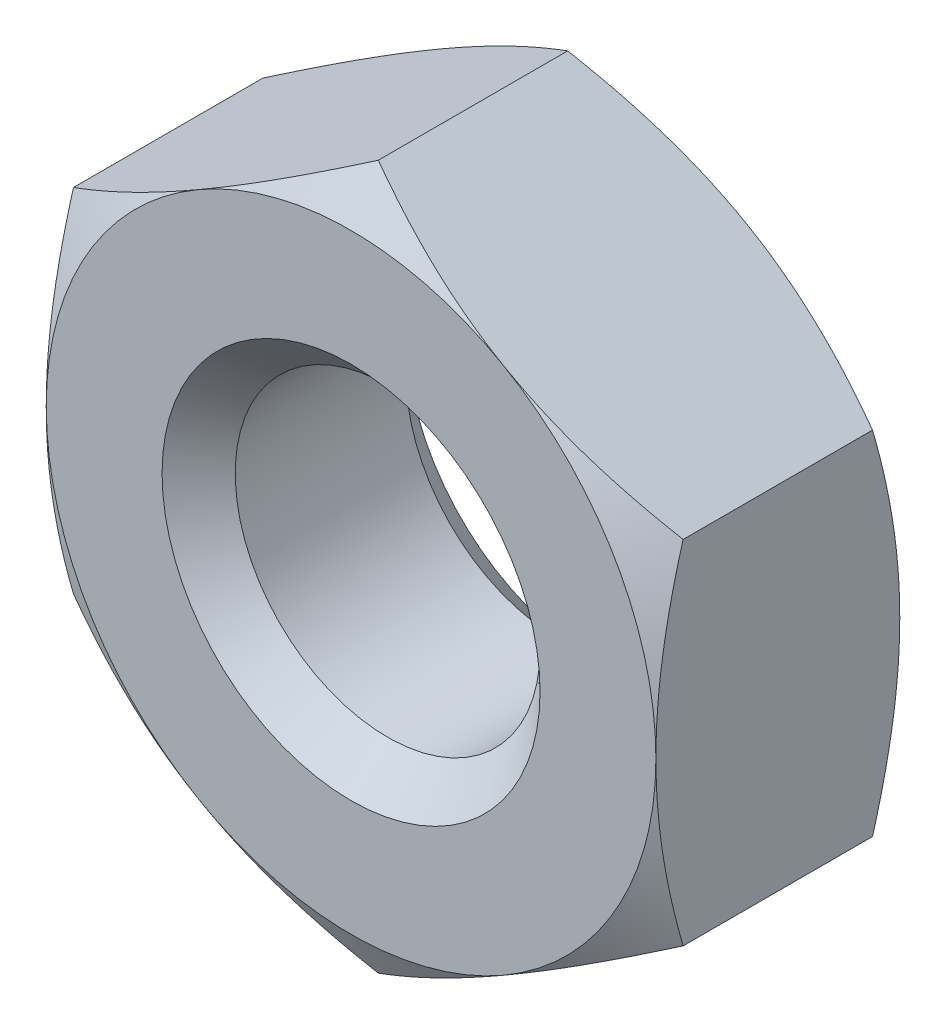
ISO-10303-21;
HEADER;
FILE_DESCRIPTION(('STEP AP214'),'2;1');
FILE_NAME('part.step','',(''),(''),'','','');
FILE_SCHEMA(('AUTOMOTIVE_DESIGN { 1 0 10303 214 1 1 1 1 }'));
ENDSEC;
DATA;
#1=APPLICATION_CONTEXT('core data for automotive mechanical design processes');
#2=APPLICATION_PROTOCOL_DEFINITION('international standard','automotive_design',2000,#1);
#3=PRODUCT_CONTEXT('',#1,'mechanical');
#4=PRODUCT('Part','Part','',(#3));
#5=PRODUCT_RELATED_PRODUCT_CATEGORY('part','',(#4));
#6=PRODUCT_DEFINITION_FORMATION('','',#4);
#7=PRODUCT_DEFINITION_CONTEXT('part definition',#1,'design');
#8=PRODUCT_DEFINITION('design','',#6,#7);
#9=PRODUCT_DEFINITION_SHAPE('','',#8);
#10=(LENGTH_UNIT() NAMED_UNIT(*) SI_UNIT(.MILLI.,.METRE.));
#11=(NAMED_UNIT(*) PLANE_ANGLE_UNIT() SI_UNIT($,.RADIAN.));
#12=(NAMED_UNIT(*) SI_UNIT($,.STERADIAN.) SOLID_ANGLE_UNIT());
#13=UNCERTAINTY_MEASURE_WITH_UNIT(LENGTH_MEASURE(1.E-05),#10,'distance_accuracy_value','');
#14=(GEOMETRIC_REPRESENTATION_CONTEXT(3) GLOBAL_UNCERTAINTY_ASSIGNED_CONTEXT((#13)) GLOBAL_UNIT_ASSIGNED_CONTEXT((#10,
#11,#12)) REPRESENTATION_CONTEXT('',''));
#15=CARTESIAN_POINT('',(0.,0.,0.));
#16=DIRECTION('',(0.,0.,1.));
#17=DIRECTION('',(1.,0.,0.));
#18=AXIS2_PLACEMENT_3D('',#15,#16,#17);
#19=CARTESIAN_POINT('',(0.,0.,2.));
#20=DIRECTION('',(0.,0.,-1.));
#21=DIRECTION('',(-1.,0.,0.));
#22=AXIS2_PLACEMENT_3D('',#19,#20,#21);
#23=CONICAL_SURFACE('',#22,2.49999999999999,1.0471975511966);
#24=CARTESIAN_POINT('',(-0.000200000000001301,2.88686681600197,1.77664233564089));
#25=CARTESIAN_POINT('',(0.10966323473487,2.82343724785375,1.81327837989237));
#26=CARTESIAN_POINT('',(0.220474799896524,2.75946016087834,1.84659778103494));
#27=CARTESIAN_POINT('',(0.444016833466048,2.63039810762178,1.90475771444214));
#28=CARTESIAN_POINT('',(0.556751274528387,2.5653108477275,1.92957767085226));
#29=CARTESIAN_POINT('',(0.780822993875267,2.43594298024479,1.96821434855894));
#30=CARTESIAN_POINT('',(0.892125791767375,2.37168227992023,1.98228820381436));
#31=CARTESIAN_POINT('',(1.11525522746833,2.24285844015415,1.99909084764725));
#32=CARTESIAN_POINT('',(1.22708105401422,2.17829576909553,2.00183354879637));
#33=CARTESIAN_POINT('',(1.43604197555152,2.05765212479586,1.99613423999194));
#34=CARTESIAN_POINT('',(1.53320831755773,2.0015531110824,1.98909160561813));
#35=CARTESIAN_POINT('',(1.726907949711,1.88972057631678,1.96676858087505));
#36=CARTESIAN_POINT('',(1.82344056965973,1.8339874422038,1.95148056155973));
#37=CARTESIAN_POINT('',(2.01753972174048,1.7219242445005,1.91326090615558));
#38=CARTESIAN_POINT('',(2.11508168178214,1.66560836761316,1.89016722387448));
#39=CARTESIAN_POINT('',(2.30871060807608,1.55381665489446,1.83775334342208));
#40=CARTESIAN_POINT('',(2.40480005588618,1.49833938633502,1.80844546437545));
#41=CARTESIAN_POINT('',(2.5002,1.44326020292023,1.77664233564089));
#42=B_SPLINE_CURVE_WITH_KNOTS('',3,(#24,#25,#26,#27,#28,#29,#30,#31,#32,#33,#34,#35,#36,#37,#38,
#39,#40,#41),.UNSPECIFIED.,.F.,.F.,(4,2,2,2,2,2,2,2,4),(0.,0.396285827362226,0.79352433015205,
1.18093086852114,1.56786160134475,1.90479741793733,2.24204551660463,2.58677531536756,
2.93082800105256),.UNSPECIFIED.);
#43=CARTESIAN_POINT('',(0.,2.88675134594813,1.77670900630739));
#44=VERTEX_POINT('',#43);
#45=CARTESIAN_POINT('',(1.25,2.1650635094611,2.));
#46=VERTEX_POINT('',#45);
#47=EDGE_CURVE('E291',#44,#46,#42,.T.);
#48=ORIENTED_EDGE('',*,*,#47,.F.);
#49=CARTESIAN_POINT('',(-2.5002,1.44326020292023,1.77664233564089));
#50=CARTESIAN_POINT('',(-2.39033676526513,1.50668977106845,1.81327837989237));
#51=CARTESIAN_POINT('',(-2.27952520010348,1.57066685804385,1.84659778103494));
#52=CARTESIAN_POINT('',(-2.05598316653395,1.69972891130041,1.90475771444214));
#53=CARTESIAN_POINT('',(-1.94324872547161,1.7648161711947,1.92957767085226));
#54=CARTESIAN_POINT('',(-1.71917700612473,1.8941840386774,1.96821434855894));
#55=CARTESIAN_POINT('',(-1.60787420823262,1.95844473900197,1.98228820381436));
#56=CARTESIAN_POINT('',(-1.38474477253167,2.08726857876804,1.99909084764725));
#57=CARTESIAN_POINT('',(-1.27291894598577,2.15183124982667,2.00183354879637));
#58=CARTESIAN_POINT('',(-1.06395802444848,2.27247489412634,1.99613423999194));
#59=CARTESIAN_POINT('',(-0.96679168244227,2.32857390783979,1.98909160561813));
#60=CARTESIAN_POINT('',(-0.773092050288999,2.44040644260542,1.96676858087505));
#61=CARTESIAN_POINT('',(-0.676559430340269,2.49613957671839,1.95148056155973));
#62=CARTESIAN_POINT('',(-0.482460278259525,2.60820277442169,1.91326090615558));
#63=CARTESIAN_POINT('',(-0.384918318217861,2.66451865130903,1.89016722387448));
#64=CARTESIAN_POINT('',(-0.191289391923916,2.77631036402774,1.83775334342208));
#65=CARTESIAN_POINT('',(-0.0951999441138253,2.83178763258717,1.80844546437545));
#66=CARTESIAN_POINT('',(0.000199999999998379,2.88686681600197,1.77664233564089));
#67=B_SPLINE_CURVE_WITH_KNOTS('',3,(#49,#50,#51,#52,#53,#54,#55,#56,#57,#58,#59,#60,#61,#62,#63,
#64,#65,#66),.UNSPECIFIED.,.F.,.F.,(4,2,2,2,2,2,2,2,4),(0.,0.396285827362227,0.793524330152051,
1.18093086852114,1.56786160134475,1.90479741793733,2.24204551660463,2.58677531536756,
2.93082800105256),.UNSPECIFIED.);
#68=CARTESIAN_POINT('',(-1.25,2.16506350946109,2.));
#69=VERTEX_POINT('',#68);
#70=EDGE_CURVE('E186',#69,#44,#67,.T.);
#71=ORIENTED_EDGE('',*,*,#70,.F.);
#72=CARTESIAN_POINT('',(0.,0.,2.));
#73=DIRECTION('',(0.,0.,1.));
#74=DIRECTION('',(1.,0.,0.));
#75=AXIS2_PLACEMENT_3D('',#72,#73,#74);
#76=CIRCLE('',#75,2.49999999999999);
#77=EDGE_CURVE('E294',#46,#69,#76,.T.);
#78=ORIENTED_EDGE('',*,*,#77,.F.);
#79=EDGE_LOOP('',(#48,#71,#78));
#80=FACE_BOUND('',#79,.T.);
#81=ADVANCED_FACE('F35',(#80),#23,.T.);
#82=CARTESIAN_POINT('',(2.5,1.44337567297406,1.77670900630739));
#83=VERTEX_POINT('',#82);
#84=EDGE_CURVE('E229',#46,#83,#42,.T.);
#85=ORIENTED_EDGE('',*,*,#84,.F.);
#86=CARTESIAN_POINT('',(2.5,0.,2.));
#87=VERTEX_POINT('',#86);
#88=EDGE_CURVE('E151',#87,#46,#76,.T.);
#89=ORIENTED_EDGE('',*,*,#88,.F.);
#90=CARTESIAN_POINT('',(2.5,-3.87737227795232,0.77979313675002));
#91=CARTESIAN_POINT('',(2.5,-3.76818068958348,0.832762008165491));
#92=CARTESIAN_POINT('',(2.5,-3.6587384796046,0.885223086338559));
#93=CARTESIAN_POINT('',(2.5,-3.43921954477317,0.988844078677106));
#94=CARTESIAN_POINT('',(2.5,-3.32914272326816,1.04000378785667));
#95=CARTESIAN_POINT('',(2.5,-3.10765426447243,1.14099379431506));
#96=CARTESIAN_POINT('',(2.5,-2.9962386229426,1.19081533993302));
#97=CARTESIAN_POINT('',(2.5,-2.7725213061051,1.28842003444658));
#98=CARTESIAN_POINT('',(2.5,-2.66021967294288,1.33620327961689));
#99=CARTESIAN_POINT('',(2.5,-2.43092096724548,1.43068939973183));
#100=CARTESIAN_POINT('',(2.5,-2.3138890293604,1.47730812540334));
#101=CARTESIAN_POINT('',(2.5,-2.07845602151588,1.56701798618111));
#102=CARTESIAN_POINT('',(2.5,-1.9600547995981,1.61010872539221));
#103=CARTESIAN_POINT('',(2.5,-1.72191643140316,1.69163159742936));
#104=CARTESIAN_POINT('',(2.5,-1.60218254574553,1.73007315927602));
#105=CARTESIAN_POINT('',(2.5,-1.3609971789188,1.80106427982835));
#106=CARTESIAN_POINT('',(2.5,-1.23954625171813,1.83361569412118));
#107=CARTESIAN_POINT('',(2.5,-0.995534876584823,1.89109058132264));
#108=CARTESIAN_POINT('',(2.5,-0.872984393735114,1.9160555822448));
#109=CARTESIAN_POINT('',(2.5,-0.626358938584124,1.95694779720815));
#110=CARTESIAN_POINT('',(2.5,-0.502284111289258,1.97287586420866));
#111=CARTESIAN_POINT('',(2.5,-0.254850408947678,1.9942151356961));
#112=CARTESIAN_POINT('',(2.5,-0.131503487224332,1.99976153618413));
#113=CARTESIAN_POINT('',(2.5,0.115220442730177,2.00022315611265));
#114=CARTESIAN_POINT('',(2.5,0.238597451467685,1.99513818221843));
#115=CARTESIAN_POINT('',(2.5,0.448047931241357,1.97784054766439));
#116=CARTESIAN_POINT('',(2.5,0.534345626100641,1.96818542536289));
#117=CARTESIAN_POINT('',(2.5,0.706307406130205,1.94427497162806));
#118=CARTESIAN_POINT('',(2.5,0.791971403534972,1.93001901475582));
#119=CARTESIAN_POINT('',(2.5,1.04788877946409,1.88109717983059));
#120=CARTESIAN_POINT('',(2.5,1.21697099599183,1.84028636324471));
#121=CARTESIAN_POINT('',(2.5,1.55535316247419,1.74566880384176));
#122=CARTESIAN_POINT('',(2.5,1.72457550054301,1.69159502678857));
#123=CARTESIAN_POINT('',(2.5,1.97606010818116,1.60395640359262));
#124=CARTESIAN_POINT('',(2.5,2.05948830671247,1.57365901276236));
#125=CARTESIAN_POINT('',(2.5,2.22565579540856,1.51123050964122));
#126=CARTESIAN_POINT('',(2.5,2.3083950931981,1.47909941767674));
#127=CARTESIAN_POINT('',(2.5,2.50178910370827,1.4019292113339));
#128=CARTESIAN_POINT('',(2.5,2.61219601331829,1.35627094627214));
#129=CARTESIAN_POINT('',(2.5,2.83208152280721,1.26276602730984));
#130=CARTESIAN_POINT('',(2.5,2.9415600711202,1.21491925278003));
#131=CARTESIAN_POINT('',(2.5,3.26887677326629,1.06876727238483));
#132=CARTESIAN_POINT('',(2.5,3.48555473812832,0.967867280104535));
#133=CARTESIAN_POINT('',(2.5,3.91694667778471,0.761461343379335));
#134=CARTESIAN_POINT('',(2.5,4.13165848343979,0.655950915073207));
#135=CARTESIAN_POINT('',(2.5,4.55953257139314,0.441822341734688));
#136=CARTESIAN_POINT('',(2.5,4.77269479742369,0.333204084551975));
#137=CARTESIAN_POINT('',(2.5,5.18031783361245,0.122829494039193));
#138=CARTESIAN_POINT('',(2.5,5.37486893535219,0.0212475029400443));
#139=CARTESIAN_POINT('',(2.5,5.76324241323614,-0.183314602035731));
#140=CARTESIAN_POINT('',(2.5,5.95706476422523,-0.286294763619006));
#141=CARTESIAN_POINT('',(2.5,6.34366555964604,-0.493069085324488));
#142=CARTESIAN_POINT('',(2.5,6.53644539741446,-0.596860644228899));
#143=CARTESIAN_POINT('',(2.5,6.92153786001119,-0.805282454493697));
#144=CARTESIAN_POINT('',(2.5,7.11385050959766,-0.909912660089123));
#145=CARTESIAN_POINT('',(2.5,7.30599070013422,-1.01485641723267));
#146=B_SPLINE_CURVE_WITH_KNOTS('',3,(#90,#91,#92,#93,#94,#95,#96,#97,#98,#99,#100,#101,#102,
#103,#104,#105,#106,#107,#108,#109,#110,#111,#112,#113,#114,#115,#116,#117,#118,#119,#120,#121,
#122,#123,#124,#125,#126,#127,#128,#129,#130,#131,#132,#133,#134,#135,#136,#137,#138,#139,#140,
#141,#142,#143,#144,#145),.UNSPECIFIED.,.F.,.F.,(4,2,2,2,2,2,2,2,2,2,2,2,2,2,2,2,2,2,2,2,2,2,2,
2,2,2,2,4),(0.,0.364087595525606,0.728232189786508,1.09435882338059,1.46046814458232,
1.83835013126742,2.21627446425679,2.593418995249,2.97044450586219,3.34536737484773,
3.72025485050397,4.0902254160263,4.46020270963272,4.72058578909651,4.98100428003869,
5.50213080667959,6.03476290085633,6.30102378937355,6.567281726986,6.92567687834834,
7.28409180808606,8.00105528535376,8.7187322767494,9.43643519926078,10.0948519202905,
10.7532911637452,11.4101228359737,12.0669189056634),.UNSPECIFIED.);
#147=EDGE_CURVE('E227',#83,#87,#146,.F.);
#148=ORIENTED_EDGE('',*,*,#147,.F.);
#149=EDGE_LOOP('',(#85,#89,#148));
#150=FACE_BOUND('',#149,.T.);
#151=ADVANCED_FACE('F282',(#150),#23,.T.);
#152=CARTESIAN_POINT('',(2.5,-1.44337567297406,1.77670900630739));
#153=VERTEX_POINT('',#152);
#154=EDGE_CURVE('E222',#87,#153,#146,.F.);
#155=ORIENTED_EDGE('',*,*,#154,.F.);
#156=CARTESIAN_POINT('',(1.25,-2.1650635094611,2.));
#157=VERTEX_POINT('',#156);
#158=EDGE_CURVE('E297',#157,#87,#76,.T.);
#159=ORIENTED_EDGE('',*,*,#158,.F.);
#160=CARTESIAN_POINT('',(2.5002,-1.44326020292023,1.77664233564089));
#161=CARTESIAN_POINT('',(2.39033676526513,-1.50668977106845,1.81327837989237));
#162=CARTESIAN_POINT('',(2.27952520010348,-1.57066685804385,1.84659778103494));
#163=CARTESIAN_POINT('',(2.05598316653395,-1.69972891130041,1.90475771444214));
#164=CARTESIAN_POINT('',(1.94324872547161,-1.7648161711947,1.92957767085226));
#165=CARTESIAN_POINT('',(1.71917700612473,-1.8941840386774,1.96821434855894));
#166=CARTESIAN_POINT('',(1.60787420823262,-1.95844473900197,1.98228820381436));
#167=CARTESIAN_POINT('',(1.38474477253167,-2.08726857876804,1.99909084764725));
#168=CARTESIAN_POINT('',(1.27291894598577,-2.15183124982667,2.00183354879637));
#169=CARTESIAN_POINT('',(1.06395802444848,-2.27247489412634,1.99613423999194));
#170=CARTESIAN_POINT('',(0.966791682442271,-2.32857390783979,1.98909160561813));
#171=CARTESIAN_POINT('',(0.773092050288999,-2.44040644260542,1.96676858087505));
#172=CARTESIAN_POINT('',(0.676559430340269,-2.49613957671839,1.95148056155973));
#173=CARTESIAN_POINT('',(0.482460278259526,-2.60820277442169,1.91326090615558));
#174=CARTESIAN_POINT('',(0.384918318217861,-2.66451865130903,1.89016722387448));
#175=CARTESIAN_POINT('',(0.191289391923917,-2.77631036402774,1.83775334342208));
#176=CARTESIAN_POINT('',(0.0951999441138256,-2.83178763258717,1.80844546437545));
#177=CARTESIAN_POINT('',(-0.000199999999998669,-2.88686681600197,1.77664233564089));
#178=B_SPLINE_CURVE_WITH_KNOTS('',3,(#160,#161,#162,#163,#164,#165,#166,#167,#168,#169,#170,
#171,#172,#173,#174,#175,#176,#177),.UNSPECIFIED.,.F.,.F.,(4,2,2,2,2,2,2,2,4),(0.,
0.396285827362227,0.793524330152051,1.18093086852114,1.56786160134475,1.90479741793733,
2.24204551660463,2.58677531536756,2.93082800105256),.UNSPECIFIED.);
#179=EDGE_CURVE('E228',#153,#157,#178,.T.);
#180=ORIENTED_EDGE('',*,*,#179,.F.);
#181=EDGE_LOOP('',(#155,#159,#180));
#182=FACE_BOUND('',#181,.T.);
#183=ADVANCED_FACE('F287',(#182),#23,.T.);
#184=CARTESIAN_POINT('',(0.,-2.88675134594813,1.7767090063074));
#185=VERTEX_POINT('',#184);
#186=EDGE_CURVE('E216',#157,#185,#178,.T.);
#187=ORIENTED_EDGE('',*,*,#186,.F.);
#188=CARTESIAN_POINT('',(-1.25,-2.1650635094611,2.));
#189=VERTEX_POINT('',#188);
#190=EDGE_CURVE('E299',#189,#157,#76,.T.);
#191=ORIENTED_EDGE('',*,*,#190,.F.);
#192=CARTESIAN_POINT('',(0.000200000000001158,-2.88686681600197,1.77664233564089));
#193=CARTESIAN_POINT('',(-0.10966323473487,-2.82343724785375,1.81327837989237));
#194=CARTESIAN_POINT('',(-0.220474799896524,-2.75946016087834,1.84659778103494));
#195=CARTESIAN_POINT('',(-0.444016833466048,-2.63039810762178,1.90475771444214));
#196=CARTESIAN_POINT('',(-0.556751274528387,-2.5653108477275,1.92957767085226));
#197=CARTESIAN_POINT('',(-0.780822993875267,-2.43594298024479,1.96821434855894));
#198=CARTESIAN_POINT('',(-0.892125791767375,-2.37168227992023,1.98228820381436));
#199=CARTESIAN_POINT('',(-1.11525522746833,-2.24285844015415,1.99909084764725));
#200=CARTESIAN_POINT('',(-1.22708105401422,-2.17829576909553,2.00183354879637));
#201=CARTESIAN_POINT('',(-1.43604197555152,-2.05765212479586,1.99613423999194));
#202=CARTESIAN_POINT('',(-1.53320831755773,-2.0015531110824,1.98909160561813));
#203=CARTESIAN_POINT('',(-1.726907949711,-1.88972057631678,1.96676858087505));
#204=CARTESIAN_POINT('',(-1.82344056965973,-1.8339874422038,1.95148056155973));
#205=CARTESIAN_POINT('',(-2.01753972174048,-1.7219242445005,1.91326090615558));
#206=CARTESIAN_POINT('',(-2.11508168178214,-1.66560836761316,1.89016722387448));
#207=CARTESIAN_POINT('',(-2.30871060807608,-1.55381665489446,1.83775334342208));
#208=CARTESIAN_POINT('',(-2.40480005588618,-1.49833938633502,1.80844546437545));
#209=CARTESIAN_POINT('',(-2.5002,-1.44326020292023,1.77664233564089));
#210=B_SPLINE_CURVE_WITH_KNOTS('',3,(#192,#193,#194,#195,#196,#197,#198,#199,#200,#201,#202,
#203,#204,#205,#206,#207,#208,#209),.UNSPECIFIED.,.F.,.F.,(4,2,2,2,2,2,2,2,4),(0.,
0.396285827362226,0.79352433015205,1.18093086852114,1.56786160134475,1.90479741793733,
2.24204551660463,2.58677531536756,2.93082800105256),.UNSPECIFIED.);
#211=EDGE_CURVE('E323',#185,#189,#210,.T.);
#212=ORIENTED_EDGE('',*,*,#211,.F.);
#213=EDGE_LOOP('',(#187,#191,#212));
#214=FACE_BOUND('',#213,.T.);
#215=ADVANCED_FACE('F327',(#214),#23,.T.);
#216=CARTESIAN_POINT('',(-2.5,-1.44337567297406,1.77670900630739));
#217=VERTEX_POINT('',#216);
#218=EDGE_CURVE('E211',#189,#217,#210,.T.);
#219=ORIENTED_EDGE('',*,*,#218,.F.);
#220=CARTESIAN_POINT('',(-2.5,0.,2.));
#221=VERTEX_POINT('',#220);
#222=EDGE_CURVE('E314',#221,#189,#76,.T.);
#223=ORIENTED_EDGE('',*,*,#222,.F.);
#224=CARTESIAN_POINT('',(-2.5,-3.87737227795232,0.779793136750022));
#225=CARTESIAN_POINT('',(-2.5,-3.76818068958348,0.832762008165492));
#226=CARTESIAN_POINT('',(-2.5,-3.6587384796046,0.88522308633856));
#227=CARTESIAN_POINT('',(-2.5,-3.43921954477317,0.988844078677107));
#228=CARTESIAN_POINT('',(-2.5,-3.32914272326816,1.04000378785667));
#229=CARTESIAN_POINT('',(-2.5,-3.10765426447243,1.14099379431506));
#230=CARTESIAN_POINT('',(-2.5,-2.9962386229426,1.19081533993302));
#231=CARTESIAN_POINT('',(-2.5,-2.7725213061051,1.28842003444658));
#232=CARTESIAN_POINT('',(-2.5,-2.66021967294288,1.33620327961689));
#233=CARTESIAN_POINT('',(-2.5,-2.43092096724548,1.43068939973183));
#234=CARTESIAN_POINT('',(-2.5,-2.31388902936041,1.47730812540334));
#235=CARTESIAN_POINT('',(-2.5,-2.07845602151589,1.56701798618111));
#236=CARTESIAN_POINT('',(-2.5,-1.9600547995981,1.61010872539221));
#237=CARTESIAN_POINT('',(-2.5,-1.72191643140316,1.69163159742936));
#238=CARTESIAN_POINT('',(-2.5,-1.60218254574553,1.73007315927602));
#239=CARTESIAN_POINT('',(-2.5,-1.3609971789188,1.80106427982835));
#240=CARTESIAN_POINT('',(-2.5,-1.23954625171813,1.83361569412118));
#241=CARTESIAN_POINT('',(-2.5,-0.995534876584824,1.89109058132264));
#242=CARTESIAN_POINT('',(-2.5,-0.872984393735115,1.9160555822448));
#243=CARTESIAN_POINT('',(-2.5,-0.626358938584125,1.95694779720815));
#244=CARTESIAN_POINT('',(-2.5,-0.502284111289259,1.97287586420866));
#245=CARTESIAN_POINT('',(-2.5,-0.254850408947679,1.9942151356961));
#246=CARTESIAN_POINT('',(-2.5,-0.131503487224332,1.99976153618413));
#247=CARTESIAN_POINT('',(-2.5,0.115220442730176,2.00022315611265));
#248=CARTESIAN_POINT('',(-2.5,0.238597451467684,1.99513818221843));
#249=CARTESIAN_POINT('',(-2.5,0.448047931241356,1.97784054766439));
#250=CARTESIAN_POINT('',(-2.5,0.534345626100639,1.96818542536289));
#251=CARTESIAN_POINT('',(-2.5,0.706307406130204,1.94427497162806));
#252=CARTESIAN_POINT('',(-2.5,0.79197140353497,1.93001901475582));
#253=CARTESIAN_POINT('',(-2.5,1.04788877946409,1.88109717983059));
#254=CARTESIAN_POINT('',(-2.5,1.21697099599183,1.84028636324471));
#255=CARTESIAN_POINT('',(-2.5,1.55535316247419,1.74566880384176));
#256=CARTESIAN_POINT('',(-2.5,1.72457550054301,1.69159502678857));
#257=CARTESIAN_POINT('',(-2.5,1.97606010818116,1.60395640359262));
#258=CARTESIAN_POINT('',(-2.5,2.05948830671247,1.57365901276236));
#259=CARTESIAN_POINT('',(-2.5,2.22565579540856,1.51123050964122));
#260=CARTESIAN_POINT('',(-2.5,2.3083950931981,1.47909941767674));
#261=CARTESIAN_POINT('',(-2.5,2.50178910370827,1.4019292113339));
#262=CARTESIAN_POINT('',(-2.5,2.61219601331829,1.35627094627214));
#263=CARTESIAN_POINT('',(-2.5,2.83208152280721,1.26276602730984));
#264=CARTESIAN_POINT('',(-2.5,2.9415600711202,1.21491925278003));
#265=CARTESIAN_POINT('',(-2.5,3.26887677326629,1.06876727238483));
#266=CARTESIAN_POINT('',(-2.5,3.48555473812832,0.967867280104535));
#267=CARTESIAN_POINT('',(-2.5,3.91694667778471,0.761461343379335));
#268=CARTESIAN_POINT('',(-2.5,4.13165848343979,0.655950915073207));
#269=CARTESIAN_POINT('',(-2.5,4.55953257139313,0.441822341734687));
#270=CARTESIAN_POINT('',(-2.5,4.77269479742369,0.333204084551975));
#271=CARTESIAN_POINT('',(-2.5,5.18031783361245,0.122829494039193));
#272=CARTESIAN_POINT('',(-2.5,5.37486893535219,0.0212475029400446));
#273=CARTESIAN_POINT('',(-2.5,5.76324241323614,-0.183314602035731));
#274=CARTESIAN_POINT('',(-2.5,5.95706476422522,-0.286294763619005));
#275=CARTESIAN_POINT('',(-2.5,6.34366555964604,-0.493069085324487));
#276=CARTESIAN_POINT('',(-2.5,6.53644539741446,-0.596860644228898));
#277=CARTESIAN_POINT('',(-2.5,6.92153786001119,-0.805282454493696));
#278=CARTESIAN_POINT('',(-2.5,7.11385050959766,-0.909912660089122));
#279=CARTESIAN_POINT('',(-2.5,7.30599070013421,-1.01485641723267));
#280=B_SPLINE_CURVE_WITH_KNOTS('',3,(#224,#225,#226,#227,#228,#229,#230,#231,#232,#233,#234,
#235,#236,#237,#238,#239,#240,#241,#242,#243,#244,#245,#246,#247,#248,#249,#250,#251,#252,#253,
#254,#255,#256,#257,#258,#259,#260,#261,#262,#263,#264,#265,#266,#267,#268,#269,#270,#271,#272,
#273,#274,#275,#276,#277,#278,#279),.UNSPECIFIED.,.F.,.F.,(4,2,2,2,2,2,2,2,2,2,2,2,2,2,2,2,2,2,
2,2,2,2,2,2,2,2,2,4),(0.,0.364087595525606,0.728232189786507,1.09435882338059,1.46046814458232,
1.83835013126741,2.21627446425679,2.593418995249,2.97044450586218,3.34536737484772,
3.72025485050397,4.0902254160263,4.46020270963271,4.72058578909651,4.98100428003869,
5.50213080667959,6.03476290085633,6.30102378937355,6.56728172698599,6.92567687834833,
7.28409180808605,8.00105528535376,8.7187322767494,9.43643519926077,10.0948519202905,
10.7532911637452,11.4101228359737,12.0669189056634),.UNSPECIFIED.);
#281=EDGE_CURVE('E319',#217,#221,#280,.T.);
#282=ORIENTED_EDGE('',*,*,#281,.F.);
#283=EDGE_LOOP('',(#219,#223,#282));
#284=FACE_BOUND('',#283,.T.);
#285=ADVANCED_FACE('F203',(#284),#23,.T.);
#286=CARTESIAN_POINT('',(0.,0.,0.577350269189626));
#287=DIRECTION('',(0.,0.,1.));
#288=DIRECTION('',(1.,0.,0.));
#289=AXIS2_PLACEMENT_3D('',#286,#287,#288);
#290=CONICAL_SURFACE('',#289,3.5,1.0471975511966);
#291=CARTESIAN_POINT('',(-0.000199999999998916,-2.88686681600197,0.223357664359111));
#292=CARTESIAN_POINT('',(0.109663234734872,-2.82343724785375,0.186721620107629));
#293=CARTESIAN_POINT('',(0.220474799896527,-2.75946016087834,0.153402218965059));
#294=CARTESIAN_POINT('',(0.444016833466051,-2.63039810762178,0.0952422855578609));
#295=CARTESIAN_POINT('',(0.556751274528389,-2.5653108477275,0.0704223291477416));
#296=CARTESIAN_POINT('',(0.78082299387527,-2.43594298024479,0.0317856514410556));
#297=CARTESIAN_POINT('',(0.892125791767378,-2.37168227992023,0.0177117961856426));
#298=CARTESIAN_POINT('',(1.11525522746833,-2.24285844015415,0.000909152352754033));
#299=CARTESIAN_POINT('',(1.22708105401423,-2.17829576909553,-0.00183354879636961));
#300=CARTESIAN_POINT('',(1.43604197555152,-2.05765212479586,0.00386576000805727));
#301=CARTESIAN_POINT('',(1.53320831755773,-2.0015531110824,0.0109083943818654));
#302=CARTESIAN_POINT('',(1.726907949711,-1.88972057631678,0.0332314191249463));
#303=CARTESIAN_POINT('',(1.82344056965973,-1.8339874422038,0.0485194384402709));
#304=CARTESIAN_POINT('',(2.01753972174048,-1.7219242445005,0.0867390938444241));
#305=CARTESIAN_POINT('',(2.11508168178214,-1.66560836761316,0.109832776125521));
#306=CARTESIAN_POINT('',(2.30871060807609,-1.55381665489446,0.162246656577917));
#307=CARTESIAN_POINT('',(2.40480005588618,-1.49833938633502,0.191554535624552));
#308=CARTESIAN_POINT('',(2.5002,-1.44326020292023,0.223357664359112));
#309=B_SPLINE_CURVE_WITH_KNOTS('',3,(#291,#292,#293,#294,#295,#296,#297,#298,#299,#300,#301,
#302,#303,#304,#305,#306,#307,#308),.UNSPECIFIED.,.F.,.F.,(4,2,2,2,2,2,2,2,4),(0.,
0.396285827362226,0.793524330152051,1.18093086852114,1.56786160134475,1.90479741793733,
2.24204551660463,2.58677531536756,2.93082800105256),.UNSPECIFIED.);
#310=CARTESIAN_POINT('',(0.,-2.88675134594813,0.223290993692604));
#311=VERTEX_POINT('',#310);
#312=CARTESIAN_POINT('',(1.25,-2.1650635094611,0.));
#313=VERTEX_POINT('',#312);
#314=EDGE_CURVE('E259',#311,#313,#309,.T.);
#315=ORIENTED_EDGE('',*,*,#314,.F.);
#316=CARTESIAN_POINT('',(-2.5002,-1.44326020292023,0.223357664359111));
#317=CARTESIAN_POINT('',(-2.39033676526513,-1.50668977106845,0.186721620107629));
#318=CARTESIAN_POINT('',(-2.27952520010347,-1.57066685804385,0.153402218965059));
#319=CARTESIAN_POINT('',(-2.05598316653395,-1.69972891130041,0.0952422855578611));
#320=CARTESIAN_POINT('',(-1.94324872547161,-1.7648161711947,0.0704223291477416));
#321=CARTESIAN_POINT('',(-1.71917700612473,-1.8941840386774,0.0317856514410554));
#322=CARTESIAN_POINT('',(-1.60787420823262,-1.95844473900197,0.0177117961856422));
#323=CARTESIAN_POINT('',(-1.38474477253167,-2.08726857876804,0.000909152352753463));
#324=CARTESIAN_POINT('',(-1.27291894598577,-2.15183124982667,-0.00183354879637015));
#325=CARTESIAN_POINT('',(-1.06395802444848,-2.27247489412634,0.00386576000805671));
#326=CARTESIAN_POINT('',(-0.966791682442269,-2.32857390783979,0.0109083943818648));
#327=CARTESIAN_POINT('',(-0.773092050288997,-2.44040644260542,0.0332314191249456));
#328=CARTESIAN_POINT('',(-0.676559430340268,-2.49613957671839,0.0485194384402703));
#329=CARTESIAN_POINT('',(-0.482460278259523,-2.60820277442169,0.0867390938444233));
#330=CARTESIAN_POINT('',(-0.384918318217859,-2.66451865130903,0.10983277612552));
#331=CARTESIAN_POINT('',(-0.191289391923914,-2.77631036402774,0.162246656577916));
#332=CARTESIAN_POINT('',(-0.0951999441138231,-2.83178763258717,0.191554535624551));
#333=CARTESIAN_POINT('',(0.000200000000001202,-2.88686681600197,0.223357664359111));
#334=B_SPLINE_CURVE_WITH_KNOTS('',3,(#316,#317,#318,#319,#320,#321,#322,#323,#324,#325,#326,
#327,#328,#329,#330,#331,#332,#333),.UNSPECIFIED.,.F.,.F.,(4,2,2,2,2,2,2,2,4),(0.,
0.396285827362226,0.79352433015205,1.18093086852114,1.56786160134475,1.90479741793733,
2.24204551660463,2.58677531536756,2.93082800105256),.UNSPECIFIED.);
#335=CARTESIAN_POINT('',(-1.25,-2.1650635094611,0.));
#336=VERTEX_POINT('',#335);
#337=EDGE_CURVE('E260',#336,#311,#334,.T.);
#338=ORIENTED_EDGE('',*,*,#337,.F.);
#339=CARTESIAN_POINT('',(0.,0.,0.));
#340=DIRECTION('',(0.,0.,1.));
#341=DIRECTION('',(1.,0.,0.));
#342=AXIS2_PLACEMENT_3D('',#339,#340,#341);
#343=CIRCLE('',#342,2.49999999999999);
#344=EDGE_CURVE('E162',#313,#336,#343,.F.);
#345=ORIENTED_EDGE('',*,*,#344,.F.);
#346=EDGE_LOOP('',(#315,#338,#345));
#347=FACE_BOUND('',#346,.T.);
#348=ADVANCED_FACE('F358',(#347),#290,.T.);
#349=CARTESIAN_POINT('',(2.5,-1.44337567297406,0.223290993692605));
#350=VERTEX_POINT('',#349);
#351=EDGE_CURVE('E254',#313,#350,#309,.T.);
#352=ORIENTED_EDGE('',*,*,#351,.F.);
#353=CARTESIAN_POINT('',(2.5,0.,0.));
#354=VERTEX_POINT('',#353);
#355=EDGE_CURVE('E153',#354,#313,#343,.F.);
#356=ORIENTED_EDGE('',*,*,#355,.F.);
#357=CARTESIAN_POINT('',(2.5,-3.87737227795232,1.22020686324998));
#358=CARTESIAN_POINT('',(2.5,-3.76818068958348,1.16723799183451));
#359=CARTESIAN_POINT('',(2.5,-3.6587384796046,1.11477691366144));
#360=CARTESIAN_POINT('',(2.5,-3.43921954477317,1.01115592132289));
#361=CARTESIAN_POINT('',(2.5,-3.32914272326816,0.959996212143326));
#362=CARTESIAN_POINT('',(2.5,-3.10765426447243,0.859006205684944));
#363=CARTESIAN_POINT('',(2.5,-2.9962386229426,0.809184660066976));
#364=CARTESIAN_POINT('',(2.5,-2.7725213061051,0.711579965553421));
#365=CARTESIAN_POINT('',(2.5,-2.66021967294288,0.663796720383113));
#366=CARTESIAN_POINT('',(2.5,-2.43092096724548,0.569310600268165));
#367=CARTESIAN_POINT('',(2.5,-2.3138890293604,0.522691874596655));
#368=CARTESIAN_POINT('',(2.5,-2.07845602151588,0.43298201381889));
#369=CARTESIAN_POINT('',(2.5,-1.9600547995981,0.389891274607794));
#370=CARTESIAN_POINT('',(2.5,-1.72191643140316,0.308368402570639));
#371=CARTESIAN_POINT('',(2.5,-1.60218254574553,0.269926840723983));
#372=CARTESIAN_POINT('',(2.5,-1.3609971789188,0.198935720171654));
#373=CARTESIAN_POINT('',(2.5,-1.23954625171813,0.166384305878817));
#374=CARTESIAN_POINT('',(2.5,-0.995534876584822,0.108909418677361));
#375=CARTESIAN_POINT('',(2.5,-0.872984393735114,0.0839444177551978));
#376=CARTESIAN_POINT('',(2.5,-0.626358938584124,0.0430522027918473));
#377=CARTESIAN_POINT('',(2.5,-0.502284111289258,0.0271241357913425));
#378=CARTESIAN_POINT('',(2.5,-0.254850408947677,0.00578486430389711));
#379=CARTESIAN_POINT('',(2.5,-0.131503487224332,0.000238463815873854));
#380=CARTESIAN_POINT('',(2.5,0.115220442730177,-0.000223156112651994));
#381=CARTESIAN_POINT('',(2.5,0.238597451467685,0.00486181778157332));
#382=CARTESIAN_POINT('',(2.5,0.448047931241357,0.0221594523356116));
#383=CARTESIAN_POINT('',(2.5,0.534345626100641,0.0318145746371115));
#384=CARTESIAN_POINT('',(2.5,0.706307406130205,0.0557250283719437));
#385=CARTESIAN_POINT('',(2.5,0.791971403534972,0.0699809852441821));
#386=CARTESIAN_POINT('',(2.5,1.04788877946409,0.118902820169406));
#387=CARTESIAN_POINT('',(2.5,1.21697099599183,0.159713636755287));
#388=CARTESIAN_POINT('',(2.5,1.55535316247419,0.254331196158239));
#389=CARTESIAN_POINT('',(2.5,1.72457550054301,0.308404973211432));
#390=CARTESIAN_POINT('',(2.5,1.97606010818117,0.396043596407382));
#391=CARTESIAN_POINT('',(2.5,2.05948830671247,0.426340987237636));
#392=CARTESIAN_POINT('',(2.5,2.22565579540856,0.48876949035878));
#393=CARTESIAN_POINT('',(2.5,2.3083950931981,0.520900582323258));
#394=CARTESIAN_POINT('',(2.5,2.50178910370828,0.598070788666104));
#395=CARTESIAN_POINT('',(2.5,2.6121960133183,0.643729053727855));
#396=CARTESIAN_POINT('',(2.5,2.83208152280721,0.73723397269016));
#397=CARTESIAN_POINT('',(2.5,2.94156007112021,0.785080747219969));
#398=CARTESIAN_POINT('',(2.5,3.26887677326629,0.931232727615166));
#399=CARTESIAN_POINT('',(2.5,3.48555473812832,1.03213271989546));
#400=CARTESIAN_POINT('',(2.5,3.91694667778471,1.23853865662066));
#401=CARTESIAN_POINT('',(2.5,4.13165848343979,1.34404908492679));
#402=CARTESIAN_POINT('',(2.5,4.55953257139314,1.55817765826531));
#403=CARTESIAN_POINT('',(2.5,4.77269479742369,1.66679591544803));
#404=CARTESIAN_POINT('',(2.5,5.18031783361245,1.87717050596081));
#405=CARTESIAN_POINT('',(2.5,5.3748689353522,1.97875249705995));
#406=CARTESIAN_POINT('',(2.5,5.76324241323614,2.18331460203573));
#407=CARTESIAN_POINT('',(2.5,5.95706476422523,2.286294763619));
#408=CARTESIAN_POINT('',(2.5,6.34366555964605,2.49306908532449));
#409=CARTESIAN_POINT('',(2.5,6.53644539741446,2.5968606442289));
#410=CARTESIAN_POINT('',(2.5,6.92153786001119,2.80528245449369));
#411=CARTESIAN_POINT('',(2.5,7.11385050959766,2.90991266008912));
#412=CARTESIAN_POINT('',(2.5,7.30599070013422,3.01485641723267));
#413=B_SPLINE_CURVE_WITH_KNOTS('',3,(#357,#358,#359,#360,#361,#362,#363,#364,#365,#366,#367,
#368,#369,#370,#371,#372,#373,#374,#375,#376,#377,#378,#379,#380,#381,#382,#383,#384,#385,#386,
#387,#388,#389,#390,#391,#392,#393,#394,#395,#396,#397,#398,#399,#400,#401,#402,#403,#404,#405,
#406,#407,#408,#409,#410,#411,#412),.UNSPECIFIED.,.F.,.F.,(4,2,2,2,2,2,2,2,2,2,2,2,2,2,2,2,2,2,
2,2,2,2,2,2,2,2,2,4),(0.,0.364087595525606,0.728232189786508,1.09435882338059,1.46046814458232,
1.83835013126741,2.21627446425679,2.593418995249,2.97044450586219,3.34536737484773,
3.72025485050397,4.0902254160263,4.46020270963272,4.72058578909651,4.98100428003869,
5.50213080667959,6.03476290085633,6.30102378937355,6.567281726986,6.92567687834834,
7.28409180808606,8.00105528535376,8.7187322767494,9.43643519926078,10.0948519202905,
10.7532911637452,11.4101228359737,12.0669189056634),.UNSPECIFIED.);
#414=EDGE_CURVE('E249',#350,#354,#413,.T.);
#415=ORIENTED_EDGE('',*,*,#414,.F.);
#416=EDGE_LOOP('',(#352,#356,#415));
#417=FACE_BOUND('',#416,.T.);
#418=ADVANCED_FACE('F353',(#417),#290,.T.);
#419=CARTESIAN_POINT('',(2.5,1.44337567297406,0.223290993692604));
#420=VERTEX_POINT('',#419);
#421=EDGE_CURVE('E147',#354,#420,#413,.T.);
#422=ORIENTED_EDGE('',*,*,#421,.F.);
#423=CARTESIAN_POINT('',(1.25,2.1650635094611,0.));
#424=VERTEX_POINT('',#423);
#425=EDGE_CURVE('E145',#424,#354,#343,.F.);
#426=ORIENTED_EDGE('',*,*,#425,.F.);
#427=CARTESIAN_POINT('',(2.5002,1.44326020292023,0.223357664359111));
#428=CARTESIAN_POINT('',(2.39033676526513,1.50668977106845,0.186721620107629));
#429=CARTESIAN_POINT('',(2.27952520010347,1.57066685804385,0.153402218965059));
#430=CARTESIAN_POINT('',(2.05598316653395,1.69972891130041,0.0952422855578611));
#431=CARTESIAN_POINT('',(1.94324872547161,1.7648161711947,0.0704223291477416));
#432=CARTESIAN_POINT('',(1.71917700612473,1.8941840386774,0.0317856514410554));
#433=CARTESIAN_POINT('',(1.60787420823262,1.95844473900197,0.0177117961856422));
#434=CARTESIAN_POINT('',(1.38474477253167,2.08726857876804,0.000909152352753463));
#435=CARTESIAN_POINT('',(1.27291894598577,2.15183124982667,-0.00183354879637015));
#436=CARTESIAN_POINT('',(1.06395802444848,2.27247489412634,0.00386576000805671));
#437=CARTESIAN_POINT('',(0.966791682442269,2.32857390783979,0.0109083943818648));
#438=CARTESIAN_POINT('',(0.773092050288997,2.44040644260542,0.0332314191249456));
#439=CARTESIAN_POINT('',(0.676559430340268,2.49613957671839,0.0485194384402703));
#440=CARTESIAN_POINT('',(0.482460278259523,2.60820277442169,0.0867390938444233));
#441=CARTESIAN_POINT('',(0.384918318217859,2.66451865130903,0.10983277612552));
#442=CARTESIAN_POINT('',(0.191289391923914,2.77631036402774,0.162246656577916));
#443=CARTESIAN_POINT('',(0.0951999441138231,2.83178763258717,0.191554535624551));
#444=CARTESIAN_POINT('',(-0.000200000000001202,2.88686681600197,0.223357664359111));
#445=B_SPLINE_CURVE_WITH_KNOTS('',3,(#427,#428,#429,#430,#431,#432,#433,#434,#435,#436,#437,
#438,#439,#440,#441,#442,#443,#444),.UNSPECIFIED.,.F.,.F.,(4,2,2,2,2,2,2,2,4),(0.,
0.396285827362226,0.79352433015205,1.18093086852114,1.56786160134475,1.90479741793733,
2.24204551660463,2.58677531536756,2.93082800105256),.UNSPECIFIED.);
#446=EDGE_CURVE('E125',#420,#424,#445,.T.);
#447=ORIENTED_EDGE('',*,*,#446,.F.);
#448=EDGE_LOOP('',(#422,#426,#447));
#449=FACE_BOUND('',#448,.T.);
#450=ADVANCED_FACE('F146',(#449),#290,.T.);
#451=CARTESIAN_POINT('',(-2.5,-1.44337567297406,0.223290993692604));
#452=VERTEX_POINT('',#451);
#453=EDGE_CURVE('E250',#452,#336,#334,.T.);
#454=ORIENTED_EDGE('',*,*,#453,.F.);
#455=CARTESIAN_POINT('',(-2.5,-3.87737227795232,1.22020686324998));
#456=CARTESIAN_POINT('',(-2.5,-3.76818068958348,1.16723799183451));
#457=CARTESIAN_POINT('',(-2.5,-3.6587384796046,1.11477691366144));
#458=CARTESIAN_POINT('',(-2.5,-3.43921954477317,1.01115592132289));
#459=CARTESIAN_POINT('',(-2.5,-3.32914272326816,0.959996212143324));
#460=CARTESIAN_POINT('',(-2.5,-3.10765426447243,0.859006205684942));
#461=CARTESIAN_POINT('',(-2.5,-2.9962386229426,0.809184660066975));
#462=CARTESIAN_POINT('',(-2.5,-2.7725213061051,0.711579965553419));
#463=CARTESIAN_POINT('',(-2.5,-2.66021967294288,0.663796720383112));
#464=CARTESIAN_POINT('',(-2.5,-2.43092096724548,0.569310600268164));
#465=CARTESIAN_POINT('',(-2.5,-2.3138890293604,0.522691874596654));
#466=CARTESIAN_POINT('',(-2.5,-2.07845602151588,0.432982013818889));
#467=CARTESIAN_POINT('',(-2.5,-1.9600547995981,0.389891274607792));
#468=CARTESIAN_POINT('',(-2.5,-1.72191643140316,0.308368402570638));
#469=CARTESIAN_POINT('',(-2.5,-1.60218254574553,0.269926840723982));
#470=CARTESIAN_POINT('',(-2.5,-1.3609971789188,0.198935720171653));
#471=CARTESIAN_POINT('',(-2.5,-1.23954625171813,0.166384305878816));
#472=CARTESIAN_POINT('',(-2.5,-0.995534876584823,0.10890941867736));
#473=CARTESIAN_POINT('',(-2.5,-0.872984393735115,0.0839444177551974));
#474=CARTESIAN_POINT('',(-2.5,-0.626358938584125,0.0430522027918471));
#475=CARTESIAN_POINT('',(-2.5,-0.502284111289259,0.0271241357913424));
#476=CARTESIAN_POINT('',(-2.5,-0.254850408947679,0.00578486430389675));
#477=CARTESIAN_POINT('',(-2.5,-0.131503487224333,0.000238463815873187));
#478=CARTESIAN_POINT('',(-2.5,0.115220442730176,-0.000223156112652668));
#479=CARTESIAN_POINT('',(-2.5,0.238597451467684,0.00486181778157289));
#480=CARTESIAN_POINT('',(-2.5,0.448047931241356,0.0221594523356114));
#481=CARTESIAN_POINT('',(-2.5,0.53434562610064,0.0318145746371114));
#482=CARTESIAN_POINT('',(-2.5,0.706307406130204,0.0557250283719438));
#483=CARTESIAN_POINT('',(-2.5,0.791971403534971,0.0699809852441822));
#484=CARTESIAN_POINT('',(-2.5,1.04788877946409,0.118902820169406));
#485=CARTESIAN_POINT('',(-2.5,1.21697099599183,0.159713636755287));
#486=CARTESIAN_POINT('',(-2.5,1.55535316247419,0.25433119615824));
#487=CARTESIAN_POINT('',(-2.5,1.72457550054301,0.308404973211432));
#488=CARTESIAN_POINT('',(-2.5,1.97606010818117,0.396043596407382));
#489=CARTESIAN_POINT('',(-2.5,2.05948830671247,0.426340987237637));
#490=CARTESIAN_POINT('',(-2.5,2.22565579540856,0.48876949035878));
#491=CARTESIAN_POINT('',(-2.5,2.3083950931981,0.520900582323258));
#492=CARTESIAN_POINT('',(-2.5,2.50178910370827,0.598070788666104));
#493=CARTESIAN_POINT('',(-2.5,2.61219601331829,0.643729053727855));
#494=CARTESIAN_POINT('',(-2.5,2.83208152280721,0.73723397269016));
#495=CARTESIAN_POINT('',(-2.5,2.9415600711202,0.785080747219969));
#496=CARTESIAN_POINT('',(-2.5,3.26887677326629,0.931232727615165));
#497=CARTESIAN_POINT('',(-2.5,3.48555473812832,1.03213271989546));
#498=CARTESIAN_POINT('',(-2.5,3.91694667778471,1.23853865662066));
#499=CARTESIAN_POINT('',(-2.5,4.13165848343979,1.34404908492679));
#500=CARTESIAN_POINT('',(-2.5,4.55953257139313,1.55817765826531));
#501=CARTESIAN_POINT('',(-2.5,4.77269479742369,1.66679591544802));
#502=CARTESIAN_POINT('',(-2.5,5.18031783361245,1.87717050596081));
#503=CARTESIAN_POINT('',(-2.5,5.37486893535219,1.97875249705995));
#504=CARTESIAN_POINT('',(-2.5,5.76324241323614,2.18331460203573));
#505=CARTESIAN_POINT('',(-2.5,5.95706476422522,2.286294763619));
#506=CARTESIAN_POINT('',(-2.5,6.34366555964604,2.49306908532448));
#507=CARTESIAN_POINT('',(-2.5,6.53644539741446,2.5968606442289));
#508=CARTESIAN_POINT('',(-2.5,6.92153786001118,2.80528245449369));
#509=CARTESIAN_POINT('',(-2.5,7.11385050959766,2.90991266008912));
#510=CARTESIAN_POINT('',(-2.5,7.30599070013422,3.01485641723267));
#511=B_SPLINE_CURVE_WITH_KNOTS('',3,(#455,#456,#457,#458,#459,#460,#461,#462,#463,#464,#465,
#466,#467,#468,#469,#470,#471,#472,#473,#474,#475,#476,#477,#478,#479,#480,#481,#482,#483,#484,
#485,#486,#487,#488,#489,#490,#491,#492,#493,#494,#495,#496,#497,#498,#499,#500,#501,#502,#503,
#504,#505,#506,#507,#508,#509,#510),.UNSPECIFIED.,.F.,.F.,(4,2,2,2,2,2,2,2,2,2,2,2,2,2,2,2,2,2,
2,2,2,2,2,2,2,2,2,4),(0.,0.364087595525606,0.728232189786508,1.09435882338059,1.46046814458232,
1.83835013126742,2.21627446425679,2.593418995249,2.97044450586219,3.34536737484773,
3.72025485050397,4.0902254160263,4.46020270963271,4.72058578909651,4.98100428003869,
5.50213080667959,6.03476290085633,6.30102378937355,6.567281726986,6.92567687834834,
7.28409180808605,8.00105528535376,8.71873227674939,9.43643519926077,10.0948519202905,
10.7532911637452,11.4101228359737,12.0669189056634),.UNSPECIFIED.);
#512=CARTESIAN_POINT('',(-2.5,0.,0.));
#513=VERTEX_POINT('',#512);
#514=EDGE_CURVE('E135',#513,#452,#511,.F.);
#515=ORIENTED_EDGE('',*,*,#514,.F.);
#516=EDGE_CURVE('E158',#336,#513,#343,.F.);
#517=ORIENTED_EDGE('',*,*,#516,.F.);
#518=EDGE_LOOP('',(#454,#515,#517));
#519=FACE_BOUND('',#518,.T.);
#520=ADVANCED_FACE('F360',(#519),#290,.T.);
#521=CARTESIAN_POINT('',(0.,2.88675134594813,0.223290993692604));
#522=VERTEX_POINT('',#521);
#523=EDGE_CURVE('E129',#424,#522,#445,.T.);
#524=ORIENTED_EDGE('',*,*,#523,.F.);
#525=CARTESIAN_POINT('',(-1.25,2.16506350946109,0.));
#526=VERTEX_POINT('',#525);
#527=EDGE_CURVE('E141',#526,#424,#343,.F.);
#528=ORIENTED_EDGE('',*,*,#527,.F.);
#529=CARTESIAN_POINT('',(0.000199999999998699,2.88686681600197,0.223357664359111));
#530=CARTESIAN_POINT('',(-0.109663234734872,2.82343724785375,0.186721620107629));
#531=CARTESIAN_POINT('',(-0.220474799896527,2.75946016087834,0.153402218965059));
#532=CARTESIAN_POINT('',(-0.444016833466051,2.63039810762178,0.0952422855578609));
#533=CARTESIAN_POINT('',(-0.556751274528389,2.5653108477275,0.0704223291477416));
#534=CARTESIAN_POINT('',(-0.78082299387527,2.43594298024479,0.0317856514410554));
#535=CARTESIAN_POINT('',(-0.892125791767378,2.37168227992023,0.0177117961856423));
#536=CARTESIAN_POINT('',(-1.11525522746833,2.24285844015415,0.000909152352753698));
#537=CARTESIAN_POINT('',(-1.22708105401423,2.17829576909552,-0.00183354879636982));
#538=CARTESIAN_POINT('',(-1.43604197555152,2.05765212479586,0.0038657600080571));
#539=CARTESIAN_POINT('',(-1.53320831755773,2.0015531110824,0.0109083943818652));
#540=CARTESIAN_POINT('',(-1.726907949711,1.88972057631678,0.0332314191249459));
#541=CARTESIAN_POINT('',(-1.82344056965973,1.8339874422038,0.0485194384402704));
#542=CARTESIAN_POINT('',(-2.01753972174048,1.7219242445005,0.0867390938444236));
#543=CARTESIAN_POINT('',(-2.11508168178214,1.66560836761316,0.10983277612552));
#544=CARTESIAN_POINT('',(-2.30871060807609,1.55381665489446,0.162246656577916));
#545=CARTESIAN_POINT('',(-2.40480005588618,1.49833938633502,0.191554535624551));
#546=CARTESIAN_POINT('',(-2.5002,1.44326020292023,0.223357664359111));
#547=B_SPLINE_CURVE_WITH_KNOTS('',3,(#529,#530,#531,#532,#533,#534,#535,#536,#537,#538,#539,
#540,#541,#542,#543,#544,#545,#546),.UNSPECIFIED.,.F.,.F.,(4,2,2,2,2,2,2,2,4),(0.,
0.396285827362226,0.79352433015205,1.18093086852114,1.56786160134475,1.90479741793733,
2.24204551660463,2.58677531536756,2.93082800105256),.UNSPECIFIED.);
#548=EDGE_CURVE('E57',#522,#526,#547,.T.);
#549=ORIENTED_EDGE('',*,*,#548,.F.);
#550=EDGE_LOOP('',(#524,#528,#549));
#551=FACE_BOUND('',#550,.T.);
#552=ADVANCED_FACE('F139',(#551),#290,.T.);
#553=CARTESIAN_POINT('',(0.,0.,2.));
#554=DIRECTION('',(0.,0.,-1.));
#555=DIRECTION('',(-1.,0.,0.));
#556=AXIS2_PLACEMENT_3D('',#553,#554,#555);
#557=CYLINDRICAL_SURFACE('',#556,1.25);
#558=CARTESIAN_POINT('',(0.,0.,0.300000000000001));
#559=DIRECTION('',(0.,0.,1.));
#560=DIRECTION('',(1.,0.,0.));
#561=AXIS2_PLACEMENT_3D('',#558,#559,#560);
#562=CIRCLE('',#561,1.25);
#563=CARTESIAN_POINT('',(1.25,0.,0.300000000000001));
#564=VERTEX_POINT('',#563);
#565=EDGE_CURVE('E43',#564,#564,#562,.F.);
#566=ORIENTED_EDGE('',*,*,#565,.T.);
#567=EDGE_LOOP('',(#566));
#568=FACE_BOUND('',#567,.T.);
#569=CARTESIAN_POINT('',(0.,0.,1.7));
#570=DIRECTION('',(0.,0.,1.));
#571=DIRECTION('',(1.,0.,0.));
#572=AXIS2_PLACEMENT_3D('',#569,#570,#571);
#573=CIRCLE('',#572,1.25);
#574=CARTESIAN_POINT('',(1.25,0.,1.7));
#575=VERTEX_POINT('',#574);
#576=EDGE_CURVE('E264',#575,#575,#573,.T.);
#577=ORIENTED_EDGE('',*,*,#576,.T.);
#578=EDGE_LOOP('',(#577));
#579=FACE_BOUND('',#578,.T.);
#580=ADVANCED_FACE('F204',(#568,#579),#557,.F.);
#581=CARTESIAN_POINT('',(0.,0.,2.));
#582=DIRECTION('',(0.,0.,1.));
#583=DIRECTION('',(1.,0.,0.));
#584=AXIS2_PLACEMENT_3D('',#581,#582,#583);
#585=PLANE('',#584);
#586=CARTESIAN_POINT('',(0.,0.,2.));
#587=DIRECTION('',(0.,0.,1.));
#588=DIRECTION('',(1.,0.,0.));
#589=AXIS2_PLACEMENT_3D('',#586,#587,#588);
#590=CIRCLE('',#589,1.55);
#591=CARTESIAN_POINT('',(1.55,0.,2.));
#592=VERTEX_POINT('',#591);
#593=EDGE_CURVE('E11',#592,#592,#590,.F.);
#594=ORIENTED_EDGE('',*,*,#593,.T.);
#595=EDGE_LOOP('',(#594));
#596=FACE_BOUND('',#595,.T.);
#597=ORIENTED_EDGE('',*,*,#88,.T.);
#598=ORIENTED_EDGE('',*,*,#77,.T.);
#599=EDGE_CURVE('E312',#69,#221,#76,.T.);
#600=ORIENTED_EDGE('',*,*,#599,.T.);
#601=ORIENTED_EDGE('',*,*,#222,.T.);
#602=ORIENTED_EDGE('',*,*,#190,.T.);
#603=ORIENTED_EDGE('',*,*,#158,.T.);
#604=EDGE_LOOP('',(#597,#598,#600,#601,#602,#603));
#605=FACE_BOUND('',#604,.T.);
#606=ADVANCED_FACE('F276',(#596,#605),#585,.T.);
#607=CARTESIAN_POINT('',(0.,0.,0.));
#608=DIRECTION('',(0.,0.,1.));
#609=DIRECTION('',(1.,0.,0.));
#610=AXIS2_PLACEMENT_3D('',#607,#608,#609);
#611=PLANE('',#610);
#612=CARTESIAN_POINT('',(0.,0.,0.));
#613=DIRECTION('',(0.,0.,1.));
#614=DIRECTION('',(1.,0.,0.));
#615=AXIS2_PLACEMENT_3D('',#612,#613,#614);
#616=CIRCLE('',#615,1.55);
#617=CARTESIAN_POINT('',(1.55,0.,0.));
#618=VERTEX_POINT('',#617);
#619=EDGE_CURVE('E261',#618,#618,#616,.T.);
#620=ORIENTED_EDGE('',*,*,#619,.T.);
#621=EDGE_LOOP('',(#620));
#622=FACE_BOUND('',#621,.T.);
#623=ORIENTED_EDGE('',*,*,#355,.T.);
#624=ORIENTED_EDGE('',*,*,#344,.T.);
#625=ORIENTED_EDGE('',*,*,#516,.T.);
#626=EDGE_CURVE('E157',#513,#526,#343,.F.);
#627=ORIENTED_EDGE('',*,*,#626,.T.);
#628=ORIENTED_EDGE('',*,*,#527,.T.);
#629=ORIENTED_EDGE('',*,*,#425,.T.);
#630=EDGE_LOOP('',(#623,#624,#625,#627,#628,#629));
#631=FACE_BOUND('',#630,.T.);
#632=ADVANCED_FACE('F154',(#622,#631),#611,.F.);
#633=CARTESIAN_POINT('',(-2.5,1.44337567297406,1.77670900630739));
#634=VERTEX_POINT('',#633);
#635=EDGE_CURVE('E193',#221,#634,#280,.T.);
#636=ORIENTED_EDGE('',*,*,#635,.F.);
#637=ORIENTED_EDGE('',*,*,#599,.F.);
#638=EDGE_CURVE('E50',#634,#69,#67,.T.);
#639=ORIENTED_EDGE('',*,*,#638,.F.);
#640=EDGE_LOOP('',(#636,#637,#639));
#641=FACE_BOUND('',#640,.T.);
#642=ADVANCED_FACE('F198',(#641),#23,.T.);
#643=CARTESIAN_POINT('',(-2.5,1.44337567297406,0.223290993692604));
#644=VERTEX_POINT('',#643);
#645=EDGE_CURVE('E143',#644,#513,#511,.F.);
#646=ORIENTED_EDGE('',*,*,#645,.F.);
#647=EDGE_CURVE('E161',#526,#644,#547,.T.);
#648=ORIENTED_EDGE('',*,*,#647,.F.);
#649=ORIENTED_EDGE('',*,*,#626,.F.);
#650=EDGE_LOOP('',(#646,#648,#649));
#651=FACE_BOUND('',#650,.T.);
#652=ADVANCED_FACE('F174',(#651),#290,.T.);
#653=CARTESIAN_POINT('',(1.25,2.1650635094611,2.));
#654=DIRECTION('',(-0.5,-0.866025403784439,0.));
#655=DIRECTION('',(0.866025403784439,-0.5,0.));
#656=AXIS2_PLACEMENT_3D('',#653,#654,#655);
#657=PLANE('',#656);
#658=ORIENTED_EDGE('',*,*,#47,.T.);
#659=ORIENTED_EDGE('',*,*,#84,.T.);
#660=DIRECTION('',(0.,0.,-1.));
#661=VECTOR('',#660,1.);
#662=CARTESIAN_POINT('',(2.5,1.44337567297406,2.));
#663=LINE('',#662,#661);
#664=EDGE_CURVE('E131',#83,#420,#663,.T.);
#665=ORIENTED_EDGE('',*,*,#664,.T.);
#666=ORIENTED_EDGE('',*,*,#446,.T.);
#667=ORIENTED_EDGE('',*,*,#523,.T.);
#668=DIRECTION('',(0.,0.,-1.));
#669=VECTOR('',#668,1.);
#670=CARTESIAN_POINT('',(0.,2.88675134594813,2.));
#671=LINE('',#670,#669);
#672=EDGE_CURVE('E343',#44,#522,#671,.T.);
#673=ORIENTED_EDGE('',*,*,#672,.F.);
#674=EDGE_LOOP('',(#658,#659,#665,#666,#667,#673));
#675=FACE_BOUND('',#674,.T.);
#676=ADVANCED_FACE('F127',(#675),#657,.F.);
#677=CARTESIAN_POINT('',(2.5,0.,2.));
#678=DIRECTION('',(-1.,0.,0.));
#679=DIRECTION('',(0.,-1.,0.));
#680=AXIS2_PLACEMENT_3D('',#677,#678,#679);
#681=PLANE('',#680);
#682=ORIENTED_EDGE('',*,*,#147,.T.);
#683=ORIENTED_EDGE('',*,*,#154,.T.);
#684=DIRECTION('',(0.,0.,-1.));
#685=VECTOR('',#684,1.);
#686=CARTESIAN_POINT('',(2.5,-1.44337567297406,2.));
#687=LINE('',#686,#685);
#688=EDGE_CURVE('E335',#153,#350,#687,.T.);
#689=ORIENTED_EDGE('',*,*,#688,.T.);
#690=ORIENTED_EDGE('',*,*,#414,.T.);
#691=ORIENTED_EDGE('',*,*,#421,.T.);
#692=ORIENTED_EDGE('',*,*,#664,.F.);
#693=EDGE_LOOP('',(#682,#683,#689,#690,#691,#692));
#694=FACE_BOUND('',#693,.T.);
#695=ADVANCED_FACE('F234',(#694),#681,.F.);
#696=CARTESIAN_POINT('',(1.25,-2.1650635094611,2.));
#697=DIRECTION('',(-0.5,0.866025403784439,0.));
#698=DIRECTION('',(-0.866025403784439,-0.5,0.));
#699=AXIS2_PLACEMENT_3D('',#696,#697,#698);
#700=PLANE('',#699);
#701=ORIENTED_EDGE('',*,*,#179,.T.);
#702=ORIENTED_EDGE('',*,*,#186,.T.);
#703=DIRECTION('',(0.,0.,-1.));
#704=VECTOR('',#703,1.);
#705=CARTESIAN_POINT('',(0.,-2.88675134594813,2.));
#706=LINE('',#705,#704);
#707=EDGE_CURVE('E332',#185,#311,#706,.T.);
#708=ORIENTED_EDGE('',*,*,#707,.T.);
#709=ORIENTED_EDGE('',*,*,#314,.T.);
#710=ORIENTED_EDGE('',*,*,#351,.T.);
#711=ORIENTED_EDGE('',*,*,#688,.F.);
#712=EDGE_LOOP('',(#701,#702,#708,#709,#710,#711));
#713=FACE_BOUND('',#712,.T.);
#714=ADVANCED_FACE('F237',(#713),#700,.F.);
#715=CARTESIAN_POINT('',(-1.25,-2.1650635094611,2.));
#716=DIRECTION('',(0.5,0.866025403784439,0.));
#717=DIRECTION('',(-0.866025403784439,0.5,0.));
#718=AXIS2_PLACEMENT_3D('',#715,#716,#717);
#719=PLANE('',#718);
#720=ORIENTED_EDGE('',*,*,#211,.T.);
#721=ORIENTED_EDGE('',*,*,#218,.T.);
#722=DIRECTION('',(0.,0.,-1.));
#723=VECTOR('',#722,1.);
#724=CARTESIAN_POINT('',(-2.5,-1.44337567297406,2.));
#725=LINE('',#724,#723);
#726=EDGE_CURVE('E336',#217,#452,#725,.T.);
#727=ORIENTED_EDGE('',*,*,#726,.T.);
#728=ORIENTED_EDGE('',*,*,#453,.T.);
#729=ORIENTED_EDGE('',*,*,#337,.T.);
#730=ORIENTED_EDGE('',*,*,#707,.F.);
#731=EDGE_LOOP('',(#720,#721,#727,#728,#729,#730));
#732=FACE_BOUND('',#731,.T.);
#733=ADVANCED_FACE('F331',(#732),#719,.F.);
#734=CARTESIAN_POINT('',(-2.5,0.,2.));
#735=DIRECTION('',(1.,0.,0.));
#736=DIRECTION('',(0.,1.,0.));
#737=AXIS2_PLACEMENT_3D('',#734,#735,#736);
#738=PLANE('',#737);
#739=ORIENTED_EDGE('',*,*,#281,.T.);
#740=ORIENTED_EDGE('',*,*,#635,.T.);
#741=DIRECTION('',(0.,0.,-1.));
#742=VECTOR('',#741,1.);
#743=CARTESIAN_POINT('',(-2.5,1.44337567297406,2.));
#744=LINE('',#743,#742);
#745=EDGE_CURVE('E338',#634,#644,#744,.T.);
#746=ORIENTED_EDGE('',*,*,#745,.T.);
#747=ORIENTED_EDGE('',*,*,#645,.T.);
#748=ORIENTED_EDGE('',*,*,#514,.T.);
#749=ORIENTED_EDGE('',*,*,#726,.F.);
#750=EDGE_LOOP('',(#739,#740,#746,#747,#748,#749));
#751=FACE_BOUND('',#750,.T.);
#752=ADVANCED_FACE('F181',(#751),#738,.F.);
#753=CARTESIAN_POINT('',(-1.25,2.1650635094611,2.));
#754=DIRECTION('',(0.5,-0.866025403784438,0.));
#755=DIRECTION('',(0.866025403784439,0.5,0.));
#756=AXIS2_PLACEMENT_3D('',#753,#754,#755);
#757=PLANE('',#756);
#758=ORIENTED_EDGE('',*,*,#638,.T.);
#759=ORIENTED_EDGE('',*,*,#70,.T.);
#760=ORIENTED_EDGE('',*,*,#672,.T.);
#761=ORIENTED_EDGE('',*,*,#548,.T.);
#762=ORIENTED_EDGE('',*,*,#647,.T.);
#763=ORIENTED_EDGE('',*,*,#745,.F.);
#764=EDGE_LOOP('',(#758,#759,#760,#761,#762,#763));
#765=FACE_BOUND('',#764,.T.);
#766=ADVANCED_FACE('F177',(#765),#757,.F.);
#767=CARTESIAN_POINT('',(0.,0.,0.));
#768=DIRECTION('',(0.,0.,-1.));
#769=DIRECTION('',(-1.,0.,0.));
#770=AXIS2_PLACEMENT_3D('',#767,#768,#769);
#771=CONICAL_SURFACE('',#770,1.55,0.785398163397446);
#772=ORIENTED_EDGE('',*,*,#565,.F.);
#773=EDGE_LOOP('',(#772));
#774=FACE_BOUND('',#773,.T.);
#775=ORIENTED_EDGE('',*,*,#619,.F.);
#776=EDGE_LOOP('',(#775));
#777=FACE_BOUND('',#776,.T.);
#778=ADVANCED_FACE('F180',(#774,#777),#771,.F.);
#779=CARTESIAN_POINT('',(0.,0.,1.7));
#780=DIRECTION('',(0.,0.,1.));
#781=DIRECTION('',(1.,0.,0.));
#782=AXIS2_PLACEMENT_3D('',#779,#780,#781);
#783=CONICAL_SURFACE('',#782,1.25,0.78539816339745);
#784=ORIENTED_EDGE('',*,*,#593,.F.);
#785=EDGE_LOOP('',(#784));
#786=FACE_BOUND('',#785,.T.);
#787=ORIENTED_EDGE('',*,*,#576,.F.);
#788=EDGE_LOOP('',(#787));
#789=FACE_BOUND('',#788,.T.);
#790=ADVANCED_FACE('F37',(#786,#789),#783,.F.);
#791=CLOSED_SHELL('',(#81,#151,#183,#215,#285,#348,#418,#450,#520,#552,#580,#606,#632,#642,#652,
#676,#695,#714,#733,#752,#766,#778,#790));
#792=MANIFOLD_SOLID_BREP('B2',#791);
#793=ADVANCED_BREP_SHAPE_REPRESENTATION('',(#18,#792),#14);
#794=SHAPE_DEFINITION_REPRESENTATION(#9,#793);
ENDSEC;
END-ISO-10303-21;
